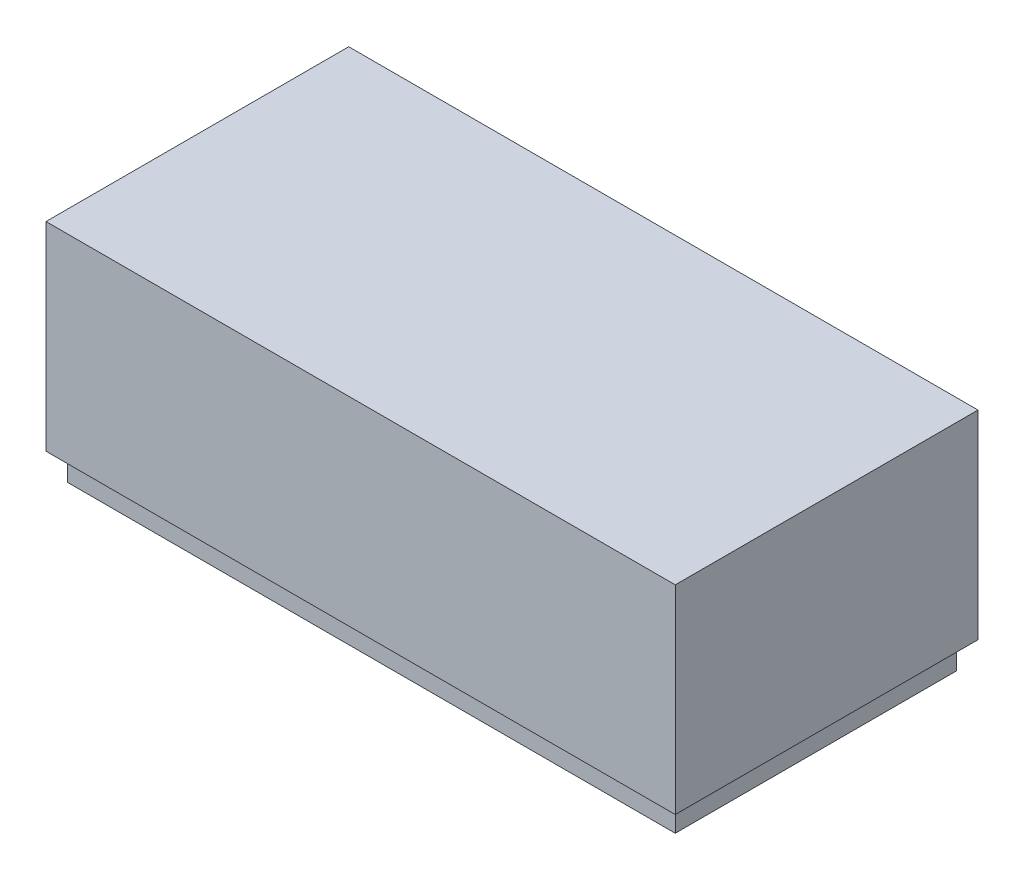
ISO-10303-21;
HEADER;
FILE_DESCRIPTION(('STEP AP214'),'2;1');
FILE_NAME('part.step','',(''),(''),'','','');
FILE_SCHEMA(('AUTOMOTIVE_DESIGN { 1 0 10303 214 1 1 1 1 }'));
ENDSEC;
DATA;
#1=APPLICATION_CONTEXT('core data for automotive mechanical design processes');
#2=APPLICATION_PROTOCOL_DEFINITION('international standard','automotive_design',2000,#1);
#3=PRODUCT_CONTEXT('',#1,'mechanical');
#4=PRODUCT('Part','Part','',(#3));
#5=PRODUCT_RELATED_PRODUCT_CATEGORY('part','',(#4));
#6=PRODUCT_DEFINITION_FORMATION('','',#4);
#7=PRODUCT_DEFINITION_CONTEXT('part definition',#1,'design');
#8=PRODUCT_DEFINITION('design','',#6,#7);
#9=PRODUCT_DEFINITION_SHAPE('','',#8);
#10=(LENGTH_UNIT() NAMED_UNIT(*) SI_UNIT(.MILLI.,.METRE.));
#11=(NAMED_UNIT(*) PLANE_ANGLE_UNIT() SI_UNIT($,.RADIAN.));
#12=(NAMED_UNIT(*) SI_UNIT($,.STERADIAN.) SOLID_ANGLE_UNIT());
#13=UNCERTAINTY_MEASURE_WITH_UNIT(LENGTH_MEASURE(1.E-05),#10,'distance_accuracy_value','');
#14=(GEOMETRIC_REPRESENTATION_CONTEXT(3) GLOBAL_UNCERTAINTY_ASSIGNED_CONTEXT((#13)) GLOBAL_UNIT_ASSIGNED_CONTEXT((#10,
#11,#12)) REPRESENTATION_CONTEXT('',''));
#15=CARTESIAN_POINT('',(0.,0.,0.));
#16=DIRECTION('',(0.,0.,1.));
#17=DIRECTION('',(1.,0.,0.));
#18=AXIS2_PLACEMENT_3D('',#15,#16,#17);
#19=CARTESIAN_POINT('',(0.,0.,0.));
#20=DIRECTION('',(0.,1.,0.));
#21=DIRECTION('',(0.,0.,1.));
#22=AXIS2_PLACEMENT_3D('',#19,#20,#21);
#23=PLANE('',#22);
#24=DIRECTION('',(0.,0.,1.));
#25=VECTOR('',#24,1.);
#26=CARTESIAN_POINT('',(-29.1,0.,14.));
#27=LINE('',#26,#25);
#28=CARTESIAN_POINT('',(-29.1,0.,-14.));
#29=VERTEX_POINT('',#28);
#30=CARTESIAN_POINT('',(-29.1,0.,14.));
#31=VERTEX_POINT('',#30);
#32=EDGE_CURVE('E128',#29,#31,#27,.T.);
#33=ORIENTED_EDGE('',*,*,#32,.F.);
#34=DIRECTION('',(-1.,0.,0.));
#35=VECTOR('',#34,1.);
#36=CARTESIAN_POINT('',(29.1,0.,-14.));
#37=LINE('',#36,#35);
#38=CARTESIAN_POINT('',(29.1,0.,-14.));
#39=VERTEX_POINT('',#38);
#40=EDGE_CURVE('E144',#39,#29,#37,.T.);
#41=ORIENTED_EDGE('',*,*,#40,.F.);
#42=DIRECTION('',(0.,0.,-1.));
#43=VECTOR('',#42,1.);
#44=CARTESIAN_POINT('',(29.1,0.,14.));
#45=LINE('',#44,#43);
#46=CARTESIAN_POINT('',(29.1,0.,14.));
#47=VERTEX_POINT('',#46);
#48=EDGE_CURVE('E156',#47,#39,#45,.T.);
#49=ORIENTED_EDGE('',*,*,#48,.F.);
#50=DIRECTION('',(1.,0.,0.));
#51=VECTOR('',#50,1.);
#52=CARTESIAN_POINT('',(29.1,0.,14.));
#53=LINE('',#52,#51);
#54=EDGE_CURVE('E133',#31,#47,#53,.T.);
#55=ORIENTED_EDGE('',*,*,#54,.F.);
#56=EDGE_LOOP('',(#33,#41,#49,#55));
#57=FACE_BOUND('',#56,.T.);
#58=DIRECTION('',(-1.,0.,0.));
#59=VECTOR('',#58,1.);
#60=CARTESIAN_POINT('',(28.1,0.,13.));
#61=LINE('',#60,#59);
#62=CARTESIAN_POINT('',(28.1,0.,13.));
#63=VERTEX_POINT('',#62);
#64=CARTESIAN_POINT('',(-28.1,0.,13.));
#65=VERTEX_POINT('',#64);
#66=EDGE_CURVE('E55',#63,#65,#61,.T.);
#67=ORIENTED_EDGE('',*,*,#66,.F.);
#68=DIRECTION('',(0.,0.,1.));
#69=VECTOR('',#68,1.);
#70=CARTESIAN_POINT('',(28.1,0.,-13.));
#71=LINE('',#70,#69);
#72=CARTESIAN_POINT('',(28.1,0.,-13.));
#73=VERTEX_POINT('',#72);
#74=EDGE_CURVE('E59',#73,#63,#71,.T.);
#75=ORIENTED_EDGE('',*,*,#74,.F.);
#76=DIRECTION('',(1.,0.,0.));
#77=VECTOR('',#76,1.);
#78=CARTESIAN_POINT('',(-28.1,0.,-13.));
#79=LINE('',#78,#77);
#80=CARTESIAN_POINT('',(-28.1,0.,-13.));
#81=VERTEX_POINT('',#80);
#82=EDGE_CURVE('E283',#81,#73,#79,.T.);
#83=ORIENTED_EDGE('',*,*,#82,.F.);
#84=DIRECTION('',(0.,0.,-1.));
#85=VECTOR('',#84,1.);
#86=CARTESIAN_POINT('',(-28.1,0.,13.));
#87=LINE('',#86,#85);
#88=EDGE_CURVE('E293',#65,#81,#87,.T.);
#89=ORIENTED_EDGE('',*,*,#88,.F.);
#90=EDGE_LOOP('',(#67,#75,#83,#89));
#91=FACE_BOUND('',#90,.T.);
#92=ADVANCED_FACE('F39',(#57,#91),#23,.F.);
#93=CARTESIAN_POINT('',(-29.1,18.4,14.));
#94=DIRECTION('',(1.,0.,0.));
#95=DIRECTION('',(0.,0.,-1.));
#96=AXIS2_PLACEMENT_3D('',#93,#94,#95);
#97=PLANE('',#96);
#98=ORIENTED_EDGE('',*,*,#32,.T.);
#99=DIRECTION('',(0.,-1.,0.));
#100=VECTOR('',#99,1.);
#101=CARTESIAN_POINT('',(-29.1,18.4,14.));
#102=LINE('',#101,#100);
#103=CARTESIAN_POINT('',(-29.1,18.4,14.));
#104=VERTEX_POINT('',#103);
#105=EDGE_CURVE('E11',#104,#31,#102,.T.);
#106=ORIENTED_EDGE('',*,*,#105,.F.);
#107=DIRECTION('',(0.,0.,1.));
#108=VECTOR('',#107,1.);
#109=CARTESIAN_POINT('',(-29.1,18.4,14.));
#110=LINE('',#109,#108);
#111=CARTESIAN_POINT('',(-29.1,18.4,-14.));
#112=VERTEX_POINT('',#111);
#113=EDGE_CURVE('E139',#112,#104,#110,.T.);
#114=ORIENTED_EDGE('',*,*,#113,.F.);
#115=DIRECTION('',(0.,-1.,0.));
#116=VECTOR('',#115,1.);
#117=CARTESIAN_POINT('',(-29.1,18.4,-14.));
#118=LINE('',#117,#116);
#119=EDGE_CURVE('E152',#112,#29,#118,.T.);
#120=ORIENTED_EDGE('',*,*,#119,.T.);
#121=EDGE_LOOP('',(#98,#106,#114,#120));
#122=FACE_BOUND('',#121,.T.);
#123=ADVANCED_FACE('F41',(#122),#97,.F.);
#124=CARTESIAN_POINT('',(29.1,18.4,14.));
#125=DIRECTION('',(0.,0.,-1.));
#126=DIRECTION('',(-1.,0.,0.));
#127=AXIS2_PLACEMENT_3D('',#124,#125,#126);
#128=PLANE('',#127);
#129=ORIENTED_EDGE('',*,*,#54,.T.);
#130=DIRECTION('',(0.,-1.,0.));
#131=VECTOR('',#130,1.);
#132=CARTESIAN_POINT('',(29.1,18.4,14.));
#133=LINE('',#132,#131);
#134=CARTESIAN_POINT('',(29.1,18.4,14.));
#135=VERTEX_POINT('',#134);
#136=EDGE_CURVE('E48',#135,#47,#133,.T.);
#137=ORIENTED_EDGE('',*,*,#136,.F.);
#138=DIRECTION('',(1.,0.,0.));
#139=VECTOR('',#138,1.);
#140=CARTESIAN_POINT('',(29.1,18.4,14.));
#141=LINE('',#140,#139);
#142=EDGE_CURVE('E143',#104,#135,#141,.T.);
#143=ORIENTED_EDGE('',*,*,#142,.F.);
#144=ORIENTED_EDGE('',*,*,#105,.T.);
#145=EDGE_LOOP('',(#129,#137,#143,#144));
#146=FACE_BOUND('',#145,.T.);
#147=ADVANCED_FACE('F188',(#146),#128,.F.);
#148=CARTESIAN_POINT('',(29.1,18.4,14.));
#149=DIRECTION('',(-1.,0.,0.));
#150=DIRECTION('',(0.,0.,1.));
#151=AXIS2_PLACEMENT_3D('',#148,#149,#150);
#152=PLANE('',#151);
#153=ORIENTED_EDGE('',*,*,#48,.T.);
#154=DIRECTION('',(0.,-1.,0.));
#155=VECTOR('',#154,1.);
#156=CARTESIAN_POINT('',(29.1,18.4,-14.));
#157=LINE('',#156,#155);
#158=CARTESIAN_POINT('',(29.1,18.4,-14.));
#159=VERTEX_POINT('',#158);
#160=EDGE_CURVE('E164',#159,#39,#157,.T.);
#161=ORIENTED_EDGE('',*,*,#160,.F.);
#162=DIRECTION('',(0.,0.,-1.));
#163=VECTOR('',#162,1.);
#164=CARTESIAN_POINT('',(29.1,18.4,14.));
#165=LINE('',#164,#163);
#166=EDGE_CURVE('E147',#135,#159,#165,.T.);
#167=ORIENTED_EDGE('',*,*,#166,.F.);
#168=ORIENTED_EDGE('',*,*,#136,.T.);
#169=EDGE_LOOP('',(#153,#161,#167,#168));
#170=FACE_BOUND('',#169,.T.);
#171=ADVANCED_FACE('F173',(#170),#152,.F.);
#172=CARTESIAN_POINT('',(29.1,18.4,-14.));
#173=DIRECTION('',(0.,0.,1.));
#174=DIRECTION('',(1.,0.,0.));
#175=AXIS2_PLACEMENT_3D('',#172,#173,#174);
#176=PLANE('',#175);
#177=ORIENTED_EDGE('',*,*,#40,.T.);
#178=ORIENTED_EDGE('',*,*,#119,.F.);
#179=DIRECTION('',(-1.,0.,0.));
#180=VECTOR('',#179,1.);
#181=CARTESIAN_POINT('',(29.1,18.4,-14.));
#182=LINE('',#181,#180);
#183=EDGE_CURVE('E150',#159,#112,#182,.T.);
#184=ORIENTED_EDGE('',*,*,#183,.F.);
#185=ORIENTED_EDGE('',*,*,#160,.T.);
#186=EDGE_LOOP('',(#177,#178,#184,#185));
#187=FACE_BOUND('',#186,.T.);
#188=ADVANCED_FACE('F181',(#187),#176,.F.);
#189=CARTESIAN_POINT('',(0.,18.4,0.));
#190=DIRECTION('',(0.,1.,0.));
#191=DIRECTION('',(0.,0.,1.));
#192=AXIS2_PLACEMENT_3D('',#189,#190,#191);
#193=PLANE('',#192);
#194=ORIENTED_EDGE('',*,*,#113,.T.);
#195=ORIENTED_EDGE('',*,*,#142,.T.);
#196=ORIENTED_EDGE('',*,*,#166,.T.);
#197=ORIENTED_EDGE('',*,*,#183,.T.);
#198=EDGE_LOOP('',(#194,#195,#196,#197));
#199=FACE_BOUND('',#198,.T.);
#200=ADVANCED_FACE('F187',(#199),#193,.T.);
#201=CARTESIAN_POINT('',(28.1,-2.5,13.));
#202=DIRECTION('',(0.,0.,-1.));
#203=DIRECTION('',(-1.,0.,0.));
#204=AXIS2_PLACEMENT_3D('',#201,#202,#203);
#205=PLANE('',#204);
#206=ORIENTED_EDGE('',*,*,#66,.T.);
#207=DIRECTION('',(0.,1.,0.));
#208=VECTOR('',#207,1.);
#209=CARTESIAN_POINT('',(-28.1,-2.5,13.));
#210=LINE('',#209,#208);
#211=CARTESIAN_POINT('',(-28.1,-2.5,13.));
#212=VERTEX_POINT('',#211);
#213=EDGE_CURVE('E108',#212,#65,#210,.T.);
#214=ORIENTED_EDGE('',*,*,#213,.F.);
#215=DIRECTION('',(-1.,0.,0.));
#216=VECTOR('',#215,1.);
#217=CARTESIAN_POINT('',(28.1,-2.5,13.));
#218=LINE('',#217,#216);
#219=CARTESIAN_POINT('',(28.1,-2.5,13.));
#220=VERTEX_POINT('',#219);
#221=EDGE_CURVE('E115',#220,#212,#218,.T.);
#222=ORIENTED_EDGE('',*,*,#221,.F.);
#223=DIRECTION('',(0.,1.,0.));
#224=VECTOR('',#223,1.);
#225=CARTESIAN_POINT('',(28.1,-2.5,13.));
#226=LINE('',#225,#224);
#227=EDGE_CURVE('E280',#220,#63,#226,.T.);
#228=ORIENTED_EDGE('',*,*,#227,.T.);
#229=EDGE_LOOP('',(#206,#214,#222,#228));
#230=FACE_BOUND('',#229,.T.);
#231=ADVANCED_FACE('F126',(#230),#205,.F.);
#232=CARTESIAN_POINT('',(-28.1,-2.5,13.));
#233=DIRECTION('',(1.,0.,0.));
#234=DIRECTION('',(0.,0.,-1.));
#235=AXIS2_PLACEMENT_3D('',#232,#233,#234);
#236=PLANE('',#235);
#237=ORIENTED_EDGE('',*,*,#88,.T.);
#238=DIRECTION('',(0.,1.,0.));
#239=VECTOR('',#238,1.);
#240=CARTESIAN_POINT('',(-28.1,-2.5,-13.));
#241=LINE('',#240,#239);
#242=CARTESIAN_POINT('',(-28.1,-2.5,-13.));
#243=VERTEX_POINT('',#242);
#244=EDGE_CURVE('E110',#243,#81,#241,.T.);
#245=ORIENTED_EDGE('',*,*,#244,.F.);
#246=DIRECTION('',(0.,0.,-1.));
#247=VECTOR('',#246,1.);
#248=CARTESIAN_POINT('',(-28.1,-2.5,13.));
#249=LINE('',#248,#247);
#250=EDGE_CURVE('E103',#212,#243,#249,.T.);
#251=ORIENTED_EDGE('',*,*,#250,.F.);
#252=ORIENTED_EDGE('',*,*,#213,.T.);
#253=EDGE_LOOP('',(#237,#245,#251,#252));
#254=FACE_BOUND('',#253,.T.);
#255=ADVANCED_FACE('F106',(#254),#236,.F.);
#256=CARTESIAN_POINT('',(-28.1,-2.5,-13.));
#257=DIRECTION('',(0.,0.,1.));
#258=DIRECTION('',(1.,0.,0.));
#259=AXIS2_PLACEMENT_3D('',#256,#257,#258);
#260=PLANE('',#259);
#261=ORIENTED_EDGE('',*,*,#82,.T.);
#262=DIRECTION('',(0.,1.,0.));
#263=VECTOR('',#262,1.);
#264=CARTESIAN_POINT('',(28.1,-2.5,-13.));
#265=LINE('',#264,#263);
#266=CARTESIAN_POINT('',(28.1,-2.5,-13.));
#267=VERTEX_POINT('',#266);
#268=EDGE_CURVE('E135',#267,#73,#265,.T.);
#269=ORIENTED_EDGE('',*,*,#268,.F.);
#270=DIRECTION('',(1.,0.,0.));
#271=VECTOR('',#270,1.);
#272=CARTESIAN_POINT('',(-28.1,-2.5,-13.));
#273=LINE('',#272,#271);
#274=EDGE_CURVE('E114',#243,#267,#273,.T.);
#275=ORIENTED_EDGE('',*,*,#274,.F.);
#276=ORIENTED_EDGE('',*,*,#244,.T.);
#277=EDGE_LOOP('',(#261,#269,#275,#276));
#278=FACE_BOUND('',#277,.T.);
#279=ADVANCED_FACE('F212',(#278),#260,.F.);
#280=CARTESIAN_POINT('',(28.1,-2.5,-13.));
#281=DIRECTION('',(-1.,0.,0.));
#282=DIRECTION('',(0.,0.,1.));
#283=AXIS2_PLACEMENT_3D('',#280,#281,#282);
#284=PLANE('',#283);
#285=ORIENTED_EDGE('',*,*,#74,.T.);
#286=ORIENTED_EDGE('',*,*,#227,.F.);
#287=DIRECTION('',(0.,0.,1.));
#288=VECTOR('',#287,1.);
#289=CARTESIAN_POINT('',(28.1,-2.5,-13.));
#290=LINE('',#289,#288);
#291=EDGE_CURVE('E120',#267,#220,#290,.T.);
#292=ORIENTED_EDGE('',*,*,#291,.F.);
#293=ORIENTED_EDGE('',*,*,#268,.T.);
#294=EDGE_LOOP('',(#285,#286,#292,#293));
#295=FACE_BOUND('',#294,.T.);
#296=ADVANCED_FACE('F217',(#295),#284,.F.);
#297=CARTESIAN_POINT('',(0.,-2.5,0.));
#298=DIRECTION('',(0.,-1.,0.));
#299=DIRECTION('',(0.,0.,-1.));
#300=AXIS2_PLACEMENT_3D('',#297,#298,#299);
#301=PLANE('',#300);
#302=ORIENTED_EDGE('',*,*,#221,.T.);
#303=ORIENTED_EDGE('',*,*,#250,.T.);
#304=ORIENTED_EDGE('',*,*,#274,.T.);
#305=ORIENTED_EDGE('',*,*,#291,.T.);
#306=EDGE_LOOP('',(#302,#303,#304,#305));
#307=FACE_BOUND('',#306,.T.);
#308=ADVANCED_FACE('F118',(#307),#301,.T.);
#309=CLOSED_SHELL('',(#92,#123,#147,#171,#188,#200,#231,#255,#279,#296,#308));
#310=MANIFOLD_SOLID_BREP('B2',#309);
#311=ADVANCED_BREP_SHAPE_REPRESENTATION('',(#18,#310),#14);
#312=SHAPE_DEFINITION_REPRESENTATION(#9,#311);
ENDSEC;
END-ISO-10303-21;
